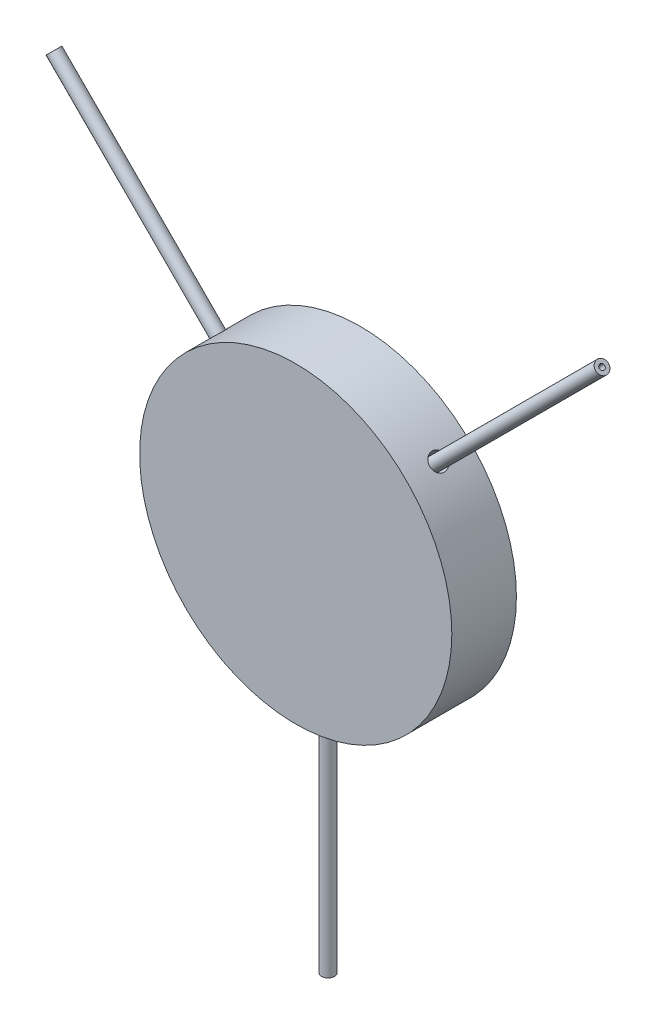
ISO-10303-21;
HEADER;
FILE_DESCRIPTION(('STEP AP214'),'2;1');
FILE_NAME('part.step','',(''),(''),'','','');
FILE_SCHEMA(('AUTOMOTIVE_DESIGN { 1 0 10303 214 1 1 1 1 }'));
ENDSEC;
DATA;
#1=APPLICATION_CONTEXT('core data for automotive mechanical design processes');
#2=APPLICATION_PROTOCOL_DEFINITION('international standard','automotive_design',2000,#1);
#3=PRODUCT_CONTEXT('',#1,'mechanical');
#4=PRODUCT('Part','Part','',(#3));
#5=PRODUCT_RELATED_PRODUCT_CATEGORY('part','',(#4));
#6=PRODUCT_DEFINITION_FORMATION('','',#4);
#7=PRODUCT_DEFINITION_CONTEXT('part definition',#1,'design');
#8=PRODUCT_DEFINITION('design','',#6,#7);
#9=PRODUCT_DEFINITION_SHAPE('','',#8);
#10=(LENGTH_UNIT() NAMED_UNIT(*) SI_UNIT(.MILLI.,.METRE.));
#11=(NAMED_UNIT(*) PLANE_ANGLE_UNIT() SI_UNIT($,.RADIAN.));
#12=(NAMED_UNIT(*) SI_UNIT($,.STERADIAN.) SOLID_ANGLE_UNIT());
#13=UNCERTAINTY_MEASURE_WITH_UNIT(LENGTH_MEASURE(1.E-05),#10,'distance_accuracy_value','');
#14=(GEOMETRIC_REPRESENTATION_CONTEXT(3) GLOBAL_UNCERTAINTY_ASSIGNED_CONTEXT((#13)) GLOBAL_UNIT_ASSIGNED_CONTEXT((#10,
#11,#12)) REPRESENTATION_CONTEXT('',''));
#15=CARTESIAN_POINT('',(0.,0.,0.));
#16=DIRECTION('',(0.,0.,1.));
#17=DIRECTION('',(1.,0.,0.));
#18=AXIS2_PLACEMENT_3D('',#15,#16,#17);
#19=CARTESIAN_POINT('',(0.,-18.,1.5));
#20=DIRECTION('',(0.,1.,0.));
#21=DIRECTION('',(0.,0.,1.));
#22=AXIS2_PLACEMENT_3D('',#19,#20,#21);
#23=CYLINDRICAL_SURFACE('',#22,0.3);
#24=CARTESIAN_POINT('',(0.,-18.,1.5));
#25=DIRECTION('',(0.,1.,0.));
#26=DIRECTION('',(0.,0.,1.));
#27=AXIS2_PLACEMENT_3D('',#24,#25,#26);
#28=CIRCLE('',#27,0.3);
#29=CARTESIAN_POINT('',(0.,-18.,1.8));
#30=VERTEX_POINT('',#29);
#31=EDGE_CURVE('E11',#30,#30,#28,.T.);
#32=ORIENTED_EDGE('',*,*,#31,.T.);
#33=EDGE_LOOP('',(#32));
#34=FACE_BOUND('',#33,.T.);
#35=CARTESIAN_POINT('',(0.,-5.,1.5));
#36=DIRECTION('',(0.,1.,0.));
#37=DIRECTION('',(0.,0.,1.));
#38=AXIS2_PLACEMENT_3D('',#35,#36,#37);
#39=CIRCLE('',#38,0.3);
#40=CARTESIAN_POINT('',(0.,-5.,1.8));
#41=VERTEX_POINT('',#40);
#42=EDGE_CURVE('E51',#41,#41,#39,.T.);
#43=ORIENTED_EDGE('',*,*,#42,.F.);
#44=EDGE_LOOP('',(#43));
#45=FACE_BOUND('',#44,.T.);
#46=ADVANCED_FACE('F48',(#34,#45),#23,.T.);
#47=CARTESIAN_POINT('',(0.,-18.,1.5));
#48=DIRECTION('',(0.,1.,0.));
#49=DIRECTION('',(0.,0.,1.));
#50=AXIS2_PLACEMENT_3D('',#47,#48,#49);
#51=PLANE('',#50);
#52=CARTESIAN_POINT('',(0.,-18.,1.5));
#53=DIRECTION('',(0.,1.,0.));
#54=DIRECTION('',(0.,0.,1.));
#55=AXIS2_PLACEMENT_3D('',#52,#53,#54);
#56=CIRCLE('',#55,0.125);
#57=CARTESIAN_POINT('',(0.,-18.,1.625));
#58=VERTEX_POINT('',#57);
#59=EDGE_CURVE('E58',#58,#58,#56,.T.);
#60=ORIENTED_EDGE('',*,*,#59,.T.);
#61=EDGE_LOOP('',(#60));
#62=FACE_BOUND('',#61,.T.);
#63=ORIENTED_EDGE('',*,*,#31,.F.);
#64=EDGE_LOOP('',(#63));
#65=FACE_BOUND('',#64,.T.);
#66=ADVANCED_FACE('F66',(#62,#65),#51,.F.);
#67=CARTESIAN_POINT('',(0.,-5.,1.5));
#68=DIRECTION('',(0.,1.,0.));
#69=DIRECTION('',(0.,0.,1.));
#70=AXIS2_PLACEMENT_3D('',#67,#68,#69);
#71=PLANE('',#70);
#72=CARTESIAN_POINT('',(0.,-5.,1.5));
#73=DIRECTION('',(0.,1.,0.));
#74=DIRECTION('',(0.,0.,1.));
#75=AXIS2_PLACEMENT_3D('',#72,#73,#74);
#76=CIRCLE('',#75,0.125);
#77=CARTESIAN_POINT('',(0.,-5.,1.625));
#78=VERTEX_POINT('',#77);
#79=EDGE_CURVE('E60',#78,#78,#76,.T.);
#80=ORIENTED_EDGE('',*,*,#79,.F.);
#81=EDGE_LOOP('',(#80));
#82=FACE_BOUND('',#81,.T.);
#83=ORIENTED_EDGE('',*,*,#42,.T.);
#84=EDGE_LOOP('',(#83));
#85=FACE_BOUND('',#84,.T.);
#86=ADVANCED_FACE('F72',(#82,#85),#71,.T.);
#87=CARTESIAN_POINT('',(0.,-18.,1.5));
#88=DIRECTION('',(0.,1.,0.));
#89=DIRECTION('',(0.,0.,1.));
#90=AXIS2_PLACEMENT_3D('',#87,#88,#89);
#91=CYLINDRICAL_SURFACE('',#90,0.125);
#92=ORIENTED_EDGE('',*,*,#59,.F.);
#93=EDGE_LOOP('',(#92));
#94=FACE_BOUND('',#93,.T.);
#95=ORIENTED_EDGE('',*,*,#79,.T.);
#96=EDGE_LOOP('',(#95));
#97=FACE_BOUND('',#96,.T.);
#98=ADVANCED_FACE('F69',(#94,#97),#91,.F.);
#99=CLOSED_SHELL('',(#46,#66,#86,#98));
#100=MANIFOLD_SOLID_BREP('B2_NOT_SHOWN',#99);
#101=CARTESIAN_POINT('',(-12.7279220613579,12.7279220613579,1.5));
#102=DIRECTION('',(-0.707106781186547,0.707106781186548,0.));
#103=DIRECTION('',(-0.707106781186548,-0.707106781186547,0.));
#104=AXIS2_PLACEMENT_3D('',#101,#102,#103);
#105=PLANE('',#104);
#106=CARTESIAN_POINT('',(-12.7279220613579,12.7279220613579,1.5));
#107=DIRECTION('',(-0.707106781186547,0.707106781186548,0.));
#108=DIRECTION('',(-0.707106781186548,-0.707106781186547,0.));
#109=AXIS2_PLACEMENT_3D('',#106,#107,#108);
#110=CIRCLE('',#109,0.3);
#111=CARTESIAN_POINT('',(-12.9400540957138,12.5157900270019,1.5));
#112=VERTEX_POINT('',#111);
#113=EDGE_CURVE('E47',#112,#112,#110,.T.);
#114=ORIENTED_EDGE('',*,*,#113,.T.);
#115=EDGE_LOOP('',(#114));
#116=FACE_BOUND('',#115,.T.);
#117=CARTESIAN_POINT('',(-12.7279220613579,12.7279220613579,1.5));
#118=DIRECTION('',(-0.707106781186547,0.707106781186548,0.));
#119=DIRECTION('',(-0.707106781186548,-0.707106781186547,0.));
#120=AXIS2_PLACEMENT_3D('',#117,#118,#119);
#121=CIRCLE('',#120,0.125);
#122=CARTESIAN_POINT('',(-12.8163104090062,12.6395337137095,1.5));
#123=VERTEX_POINT('',#122);
#124=EDGE_CURVE('E129',#123,#123,#121,.T.);
#125=ORIENTED_EDGE('',*,*,#124,.F.);
#126=EDGE_LOOP('',(#125));
#127=FACE_BOUND('',#126,.T.);
#128=ADVANCED_FACE('F118',(#116,#127),#105,.T.);
#129=CARTESIAN_POINT('',(-3.53553390593274,3.53553390593274,1.5));
#130=DIRECTION('',(-0.707106781186547,0.707106781186548,0.));
#131=DIRECTION('',(-0.707106781186548,-0.707106781186547,0.));
#132=AXIS2_PLACEMENT_3D('',#129,#130,#131);
#133=PLANE('',#132);
#134=CARTESIAN_POINT('',(-3.53553390593274,3.53553390593274,1.5));
#135=DIRECTION('',(-0.707106781186547,0.707106781186548,0.));
#136=DIRECTION('',(-0.707106781186548,-0.707106781186547,0.));
#137=AXIS2_PLACEMENT_3D('',#134,#135,#136);
#138=CIRCLE('',#137,0.3);
#139=CARTESIAN_POINT('',(-3.7476659402887,3.32340187157677,1.5));
#140=VERTEX_POINT('',#139);
#141=EDGE_CURVE('E122',#140,#140,#138,.T.);
#142=ORIENTED_EDGE('',*,*,#141,.F.);
#143=EDGE_LOOP('',(#142));
#144=FACE_BOUND('',#143,.T.);
#145=CARTESIAN_POINT('',(-3.53553390593274,3.53553390593274,1.5));
#146=DIRECTION('',(-0.707106781186547,0.707106781186548,0.));
#147=DIRECTION('',(-0.707106781186548,-0.707106781186547,0.));
#148=AXIS2_PLACEMENT_3D('',#145,#146,#147);
#149=CIRCLE('',#148,0.125);
#150=CARTESIAN_POINT('',(-3.62392225358106,3.44714555828442,1.5));
#151=VERTEX_POINT('',#150);
#152=EDGE_CURVE('E131',#151,#151,#149,.T.);
#153=ORIENTED_EDGE('',*,*,#152,.T.);
#154=EDGE_LOOP('',(#153));
#155=FACE_BOUND('',#154,.T.);
#156=ADVANCED_FACE('F141',(#144,#155),#133,.F.);
#157=CARTESIAN_POINT('',(-12.7279220613579,12.7279220613579,1.5));
#158=DIRECTION('',(0.707106781186547,-0.707106781186548,0.));
#159=DIRECTION('',(0.707106781186548,0.707106781186547,0.));
#160=AXIS2_PLACEMENT_3D('',#157,#158,#159);
#161=CYLINDRICAL_SURFACE('',#160,0.3);
#162=ORIENTED_EDGE('',*,*,#113,.F.);
#163=EDGE_LOOP('',(#162));
#164=FACE_BOUND('',#163,.T.);
#165=ORIENTED_EDGE('',*,*,#141,.T.);
#166=EDGE_LOOP('',(#165));
#167=FACE_BOUND('',#166,.T.);
#168=ADVANCED_FACE('F120',(#164,#167),#161,.T.);
#169=CARTESIAN_POINT('',(-12.7279220613579,12.7279220613579,1.5));
#170=DIRECTION('',(0.707106781186547,-0.707106781186548,0.));
#171=DIRECTION('',(0.707106781186548,0.707106781186547,0.));
#172=AXIS2_PLACEMENT_3D('',#169,#170,#171);
#173=CYLINDRICAL_SURFACE('',#172,0.125);
#174=ORIENTED_EDGE('',*,*,#124,.T.);
#175=EDGE_LOOP('',(#174));
#176=FACE_BOUND('',#175,.T.);
#177=ORIENTED_EDGE('',*,*,#152,.F.);
#178=EDGE_LOOP('',(#177));
#179=FACE_BOUND('',#178,.T.);
#180=ADVANCED_FACE('F137',(#176,#179),#173,.F.);
#181=CLOSED_SHELL('',(#128,#156,#168,#180));
#182=MANIFOLD_SOLID_BREP('B6_NOT_SHOWN',#181);
#183=CARTESIAN_POINT('',(12.7279220613579,12.7279220613579,1.5021862954209));
#184=DIRECTION('',(0.707106781186547,0.707106781186548,0.));
#185=DIRECTION('',(-0.707106781186548,0.707106781186547,0.));
#186=AXIS2_PLACEMENT_3D('',#183,#184,#185);
#187=PLANE('',#186);
#188=CARTESIAN_POINT('',(12.7279220613579,12.7279220613579,1.5021862954209));
#189=DIRECTION('',(0.707106781186547,0.707106781186548,0.));
#190=DIRECTION('',(-0.707106781186548,0.707106781186547,0.));
#191=AXIS2_PLACEMENT_3D('',#188,#189,#190);
#192=CIRCLE('',#191,0.3);
#193=CARTESIAN_POINT('',(12.5157900270019,12.9400540957138,1.5021862954209));
#194=VERTEX_POINT('',#193);
#195=EDGE_CURVE('E117',#194,#194,#192,.T.);
#196=ORIENTED_EDGE('',*,*,#195,.T.);
#197=EDGE_LOOP('',(#196));
#198=FACE_BOUND('',#197,.T.);
#199=CARTESIAN_POINT('',(12.7279220613579,12.7279220613579,1.5021862954209));
#200=DIRECTION('',(0.707106781186547,0.707106781186548,0.));
#201=DIRECTION('',(-0.707106781186548,0.707106781186547,0.));
#202=AXIS2_PLACEMENT_3D('',#199,#200,#201);
#203=CIRCLE('',#202,0.125);
#204=CARTESIAN_POINT('',(12.6395337137095,12.8163104090062,1.5021862954209));
#205=VERTEX_POINT('',#204);
#206=EDGE_CURVE('E200',#205,#205,#203,.T.);
#207=ORIENTED_EDGE('',*,*,#206,.F.);
#208=EDGE_LOOP('',(#207));
#209=FACE_BOUND('',#208,.T.);
#210=ADVANCED_FACE('F189',(#198,#209),#187,.T.);
#211=CARTESIAN_POINT('',(3.53553390593274,3.53553390593274,1.5021862954209));
#212=DIRECTION('',(0.707106781186547,0.707106781186548,0.));
#213=DIRECTION('',(-0.707106781186548,0.707106781186547,0.));
#214=AXIS2_PLACEMENT_3D('',#211,#212,#213);
#215=PLANE('',#214);
#216=CARTESIAN_POINT('',(3.53553390593274,3.53553390593274,1.5021862954209));
#217=DIRECTION('',(0.707106781186547,0.707106781186548,0.));
#218=DIRECTION('',(-0.707106781186548,0.707106781186547,0.));
#219=AXIS2_PLACEMENT_3D('',#216,#217,#218);
#220=CIRCLE('',#219,0.3);
#221=CARTESIAN_POINT('',(3.32340187157677,3.7476659402887,1.5021862954209));
#222=VERTEX_POINT('',#221);
#223=EDGE_CURVE('E193',#222,#222,#220,.T.);
#224=ORIENTED_EDGE('',*,*,#223,.F.);
#225=EDGE_LOOP('',(#224));
#226=FACE_BOUND('',#225,.T.);
#227=CARTESIAN_POINT('',(3.53553390593274,3.53553390593274,1.5021862954209));
#228=DIRECTION('',(0.707106781186547,0.707106781186548,0.));
#229=DIRECTION('',(-0.707106781186548,0.707106781186547,0.));
#230=AXIS2_PLACEMENT_3D('',#227,#228,#229);
#231=CIRCLE('',#230,0.125);
#232=CARTESIAN_POINT('',(3.44714555828442,3.62392225358106,1.5021862954209));
#233=VERTEX_POINT('',#232);
#234=EDGE_CURVE('E202',#233,#233,#231,.T.);
#235=ORIENTED_EDGE('',*,*,#234,.T.);
#236=EDGE_LOOP('',(#235));
#237=FACE_BOUND('',#236,.T.);
#238=ADVANCED_FACE('F212',(#226,#237),#215,.F.);
#239=CARTESIAN_POINT('',(12.7279220613579,12.7279220613579,1.5021862954209));
#240=DIRECTION('',(-0.707106781186547,-0.707106781186548,0.));
#241=DIRECTION('',(0.707106781186548,-0.707106781186547,0.));
#242=AXIS2_PLACEMENT_3D('',#239,#240,#241);
#243=CYLINDRICAL_SURFACE('',#242,0.3);
#244=ORIENTED_EDGE('',*,*,#195,.F.);
#245=EDGE_LOOP('',(#244));
#246=FACE_BOUND('',#245,.T.);
#247=ORIENTED_EDGE('',*,*,#223,.T.);
#248=EDGE_LOOP('',(#247));
#249=FACE_BOUND('',#248,.T.);
#250=ADVANCED_FACE('F191',(#246,#249),#243,.T.);
#251=CARTESIAN_POINT('',(12.7279220613579,12.7279220613579,1.5021862954209));
#252=DIRECTION('',(-0.707106781186547,-0.707106781186548,0.));
#253=DIRECTION('',(0.707106781186548,-0.707106781186547,0.));
#254=AXIS2_PLACEMENT_3D('',#251,#252,#253);
#255=CYLINDRICAL_SURFACE('',#254,0.125);
#256=ORIENTED_EDGE('',*,*,#206,.T.);
#257=EDGE_LOOP('',(#256));
#258=FACE_BOUND('',#257,.T.);
#259=ORIENTED_EDGE('',*,*,#234,.F.);
#260=EDGE_LOOP('',(#259));
#261=FACE_BOUND('',#260,.T.);
#262=ADVANCED_FACE('F208',(#258,#261),#255,.F.);
#263=CLOSED_SHELL('',(#210,#238,#250,#262));
#264=MANIFOLD_SOLID_BREP('B42_NOT_SHOWN',#263);
#265=CARTESIAN_POINT('',(0.,0.,3.));
#266=DIRECTION('',(0.,0.,-1.));
#267=DIRECTION('',(-1.,0.,0.));
#268=AXIS2_PLACEMENT_3D('',#265,#266,#267);
#269=CYLINDRICAL_SURFACE('',#268,7.25);
#270=CARTESIAN_POINT('',(0.,-7.25,1.9));
#271=CARTESIAN_POINT('',(-0.0224498519267231,-7.24999985273167,1.89999901034949));
#272=CARTESIAN_POINT('',(-0.0449155466798914,-7.24989460883726,1.89810366660197));
#273=CARTESIAN_POINT('',(-0.0892269629474766,-7.24948488790318,1.890569769661));
#274=CARTESIAN_POINT('',(-0.111071926060391,-7.24918017723044,1.88492682683624));
#275=CARTESIAN_POINT('',(-0.15349358792056,-7.24840600422967,1.87005998707018));
#276=CARTESIAN_POINT('',(-0.174070935443075,-7.24793662701678,1.86083793988508));
#277=CARTESIAN_POINT('',(-0.21338005744679,-7.24688595650795,1.83907757508431));
#278=CARTESIAN_POINT('',(-0.232112261164328,-7.2463046893344,1.82654003126609));
#279=CARTESIAN_POINT('',(-0.267227315234672,-7.24509482861946,1.79848795845966));
#280=CARTESIAN_POINT('',(-0.283607671513242,-7.24446618589884,1.78297030930606));
#281=CARTESIAN_POINT('',(-0.313532763873199,-7.24323284814664,1.74940484077907));
#282=CARTESIAN_POINT('',(-0.32707738310408,-7.24262815410273,1.73135691719333));
#283=CARTESIAN_POINT('',(-0.350953780315671,-7.2415105411105,1.69322963654542));
#284=CARTESIAN_POINT('',(-0.361283551713926,-7.24099767956489,1.67314902107599));
#285=CARTESIAN_POINT('',(-0.378424172349556,-7.24012218333067,1.63153521376556));
#286=CARTESIAN_POINT('',(-0.385235052591838,-7.23975954731843,1.61000203472497));
#287=CARTESIAN_POINT('',(-0.395137807194105,-7.23922585219051,1.56611781153231));
#288=CARTESIAN_POINT('',(-0.398233497299761,-7.23905459652705,1.54376763085617));
#289=CARTESIAN_POINT('',(-0.400629771970605,-7.23892238500801,1.49886424701476));
#290=CARTESIAN_POINT('',(-0.39993039152368,-7.23896142721365,1.47631104572312));
#291=CARTESIAN_POINT('',(-0.394759551023146,-7.23924522608264,1.43166778387157));
#292=CARTESIAN_POINT('',(-0.390292216033835,-7.23948975778007,1.40957724389443));
#293=CARTESIAN_POINT('',(-0.377718672538107,-7.2401566217332,1.36646009172822));
#294=CARTESIAN_POINT('',(-0.369612446163853,-7.24057895486196,1.34543348476388));
#295=CARTESIAN_POINT('',(-0.349986525644861,-7.24155408275612,1.30502779073104));
#296=CARTESIAN_POINT('',(-0.338464954474237,-7.24210694922674,1.28564961717517));
#297=CARTESIAN_POINT('',(-0.312336763745284,-7.2432807612917,1.24910085454707));
#298=CARTESIAN_POINT('',(-0.297730117417171,-7.24390170747678,1.23193028463271));
#299=CARTESIAN_POINT('',(-0.265823144633212,-7.24514269578366,1.20026013309814));
#300=CARTESIAN_POINT('',(-0.248519246885904,-7.24576273559067,1.18576414913946));
#301=CARTESIAN_POINT('',(-0.211721504128912,-7.24693123245236,1.15988239048509));
#302=CARTESIAN_POINT('',(-0.192227658500189,-7.24747968948681,1.14849661666858));
#303=CARTESIAN_POINT('',(-0.151601243810435,-7.24844324373481,1.12915880770554));
#304=CARTESIAN_POINT('',(-0.13046861289085,-7.24885833591125,1.12120690225033));
#305=CARTESIAN_POINT('',(-0.0871654546034117,-7.24950831046416,1.10896492687899));
#306=CARTESIAN_POINT('',(-0.0649949366900745,-7.24974319448188,1.10467482361295));
#307=CARTESIAN_POINT('',(-0.0202765693369092,-7.25000607133094,1.09988267618508));
#308=CARTESIAN_POINT('',(0.00227074539792376,-7.25003433590147,1.09937565661635));
#309=CARTESIAN_POINT('',(0.0471301212660416,-7.24988151055693,1.10215107872611));
#310=CARTESIAN_POINT('',(0.0694421833494029,-7.24970042148767,1.10543350509485));
#311=CARTESIAN_POINT('',(0.113183726057391,-7.2491494562456,1.11569052442225));
#312=CARTESIAN_POINT('',(0.134613741975604,-7.24877969645421,1.12266284137235));
#313=CARTESIAN_POINT('',(0.175999375166433,-7.24789300770722,1.14009941443692));
#314=CARTESIAN_POINT('',(0.195954982094769,-7.24737607771921,1.15056369504776));
#315=CARTESIAN_POINT('',(0.233848152780189,-7.24625249716785,1.17469986322166));
#316=CARTESIAN_POINT('',(0.251783592388643,-7.24564575369066,1.18837508125531));
#317=CARTESIAN_POINT('',(0.285105939602094,-7.24441116927468,1.21854007621465));
#318=CARTESIAN_POINT('',(0.300492827483852,-7.24378332817266,1.23502987492036));
#319=CARTESIAN_POINT('',(0.328298084877516,-7.24257653171065,1.2703773743197));
#320=CARTESIAN_POINT('',(0.34071323191662,-7.24199762985491,1.28923761196827));
#321=CARTESIAN_POINT('',(0.362200556163088,-7.24095483872383,1.32877782482596));
#322=CARTESIAN_POINT('',(0.371272750277436,-7.24049094886683,1.34945779083115));
#323=CARTESIAN_POINT('',(0.38581103824761,-7.23973087736011,1.39203855867289));
#324=CARTESIAN_POINT('',(0.391279176300328,-7.23943460065484,1.41393866079774));
#325=CARTESIAN_POINT('',(0.398460813863542,-7.23904290040721,1.45834780062429));
#326=CARTESIAN_POINT('',(0.400174340846878,-7.23894747539519,1.48085683386917));
#327=CARTESIAN_POINT('',(0.399797856490552,-7.23896827527617,1.52581282653404));
#328=CARTESIAN_POINT('',(0.397712913140048,-7.23908421815837,1.54825982870288));
#329=CARTESIAN_POINT('',(0.389809160587677,-7.23951409052054,1.59248456156398));
#330=CARTESIAN_POINT('',(0.383990344394406,-7.23982802037123,1.614262291003));
#331=CARTESIAN_POINT('',(0.368785102735411,-7.24061842047432,1.65653122110272));
#332=CARTESIAN_POINT('',(0.359398668634057,-7.24109489112015,1.67702241864915));
#333=CARTESIAN_POINT('',(0.337325425659902,-7.24215666152843,1.7161385362163));
#334=CARTESIAN_POINT('',(0.324638711934566,-7.24274195815327,1.73476351001903));
#335=CARTESIAN_POINT('',(0.29630659425397,-7.2439563173559,1.76964399144573));
#336=CARTESIAN_POINT('',(0.280657592510956,-7.2445854325592,1.78589657476895));
#337=CARTESIAN_POINT('',(0.2468487173008,-7.24581611787472,1.81554926078093));
#338=CARTESIAN_POINT('',(0.228688228397321,-7.24641768118714,1.82894866225129));
#339=CARTESIAN_POINT('',(0.190355164235812,-7.24752597245616,1.85252227339318));
#340=CARTESIAN_POINT('',(0.170180465960038,-7.24803259869457,1.86269303181104));
#341=CARTESIAN_POINT('',(0.128421925685863,-7.2488924758191,1.87949064740542));
#342=CARTESIAN_POINT('',(0.106839776462649,-7.24924590718059,1.88612167680076));
#343=CARTESIAN_POINT('',(0.0709369361591975,-7.24966642229911,1.89391840485355));
#344=CARTESIAN_POINT('',(0.0568486144208318,-7.24979096179987,1.89619607698614));
#345=CARTESIAN_POINT('',(0.0285089916896704,-7.24995779737135,1.89923718802048));
#346=CARTESIAN_POINT('',(0.0142576908686212,-7.25000009352874,1.90000062851778));
#347=CARTESIAN_POINT('',(0.,-7.25,1.9));
#348=B_SPLINE_CURVE_WITH_KNOTS('',3,(#270,#271,#272,#273,#274,#275,#276,#277,#278,#279,#280,
#281,#282,#283,#284,#285,#286,#287,#288,#289,#290,#291,#292,#293,#294,#295,#296,#297,#298,#299,
#300,#301,#302,#303,#304,#305,#306,#307,#308,#309,#310,#311,#312,#313,#314,#315,#316,#317,#318,
#319,#320,#321,#322,#323,#324,#325,#326,#327,#328,#329,#330,#331,#332,#333,#334,#335,#336,#337,
#338,#339,#340,#341,#342,#343,#344,#345,#346,#347),.UNSPECIFIED.,.T.,.F.,(4,2,2,2,2,2,2,2,2,2,2,
2,2,2,2,2,2,2,2,2,2,2,2,2,2,2,2,2,2,2,2,2,2,2,2,2,2,2,4),(0.,0.0672975086809392,
0.134673983520043,0.202015683054899,0.269341679688496,0.336738554664312,0.404138206276108,
0.471579842138207,0.539020883762753,0.606392599541413,0.673763694201197,0.74106112822814,
0.808358892705393,0.875693711885606,0.943029115366818,1.01045444359218,1.07787979087689,
1.14530768447838,1.21273496397247,1.28007354931908,1.34741186261211,1.41470868842824,
1.48200598634619,1.54937339761123,1.61674133020825,1.68418198708481,1.75162230287562,
1.81902433396966,1.8864258718751,1.95373754725535,2.02104934867217,2.08836131302223,
2.1556713369752,2.22306364166913,2.29047249011039,2.35795315438448,2.42535410372548,
2.46809416674077,2.51083418472098),.UNSPECIFIED.);
#349=CARTESIAN_POINT('',(0.,-7.25,1.9));
#350=VERTEX_POINT('',#349);
#351=EDGE_CURVE('E341',#350,#350,#348,.T.);
#352=ORIENTED_EDGE('',*,*,#351,.F.);
#353=EDGE_LOOP('',(#352));
#354=FACE_BOUND('',#353,.T.);
#355=CARTESIAN_POINT('',(0.,0.,3.));
#356=DIRECTION('',(0.,0.,1.));
#357=DIRECTION('',(1.,0.,0.));
#358=AXIS2_PLACEMENT_3D('',#355,#356,#357);
#359=CIRCLE('',#358,7.25);
#360=CARTESIAN_POINT('',(7.25,0.,3.));
#361=VERTEX_POINT('',#360);
#362=EDGE_CURVE('E348',#361,#361,#359,.T.);
#363=ORIENTED_EDGE('',*,*,#362,.F.);
#364=EDGE_LOOP('',(#363));
#365=FACE_BOUND('',#364,.T.);
#366=CARTESIAN_POINT('',(0.,0.,0.));
#367=DIRECTION('',(0.,0.,1.));
#368=DIRECTION('',(1.,0.,0.));
#369=AXIS2_PLACEMENT_3D('',#366,#367,#368);
#370=CIRCLE('',#369,7.25);
#371=CARTESIAN_POINT('',(7.25,0.,0.));
#372=VERTEX_POINT('',#371);
#373=EDGE_CURVE('E347',#372,#372,#370,.T.);
#374=ORIENTED_EDGE('',*,*,#373,.T.);
#375=EDGE_LOOP('',(#374));
#376=FACE_BOUND('',#375,.T.);
#377=CARTESIAN_POINT('',(-4.83587294675085,5.40155837170009,1.5));
#378=CARTESIAN_POINT('',(-4.8358737512864,5.40155777662082,1.52244982260147));
#379=CARTESIAN_POINT('',(-4.83728849331815,5.40029210458516,1.54491548812876));
#380=CARTESIAN_POINT('',(-4.84290588033164,5.39525498168596,1.58922684366934));
#381=CARTESIAN_POINT('',(-4.84711179474406,5.39148059223633,1.61107177525824));
#382=CARTESIAN_POINT('',(-4.85817227811935,5.38151625475761,1.65349337048094));
#383=CARTESIAN_POINT('',(-4.86502547833581,5.37532755500146,1.67407068315702));
#384=CARTESIAN_POINT('',(-4.88115586258618,5.36068424036268,1.71337974685388));
#385=CARTESIAN_POINT('',(-4.89043248107181,5.35223015413694,1.73211192706688));
#386=CARTESIAN_POINT('',(-4.91112404980993,5.33325016126809,1.76722700800536));
#387=CARTESIAN_POINT('',(-4.92254124768003,5.32272207632257,1.78360740713362));
#388=CARTESIAN_POINT('',(-4.94714759519088,5.29985963178116,1.81353258210042));
#389=CARTESIAN_POINT('',(-4.96033681773162,5.28752519787134,1.82707724121972));
#390=CARTESIAN_POINT('',(-4.98808664056538,5.26135487035665,1.8509536798877));
#391=CARTESIAN_POINT('',(-5.00264808687903,5.24751804967083,1.86128346025099));
#392=CARTESIAN_POINT('',(-5.03269188055208,5.21871105818778,1.87842409975566));
#393=CARTESIAN_POINT('',(-5.04817421982455,5.2037408973428,1.88523498979346));
#394=CARTESIAN_POINT('',(-5.07958189319482,5.1730869472463,1.89513776524272));
#395=CARTESIAN_POINT('',(-5.09550675546402,5.1574039075323,1.89823346712726));
#396=CARTESIAN_POINT('',(-5.12735156406097,5.12574579374711,1.90062977188378));
#397=CARTESIAN_POINT('',(-5.14327151043254,5.10977072236001,1.89993040961905));
#398=CARTESIAN_POINT('',(-5.17463874305505,5.07800273415294,1.89475959762858));
#399=CARTESIAN_POINT('',(-5.19008652493678,5.06220963798458,1.89029225467208));
#400=CARTESIAN_POINT('',(-5.22010414867581,5.03125013253478,1.87771866159991));
#401=CARTESIAN_POINT('',(-5.23467398626472,5.01608372630029,1.86961239379415));
#402=CARTESIAN_POINT('',(-5.26255633161009,4.98682363376945,1.84998638806183));
#403=CARTESIAN_POINT('',(-5.27586814630458,4.97273053959571,1.83846478287077));
#404=CARTESIAN_POINT('',(-5.30088244355809,4.94605703551127,1.81233651983765));
#405=CARTESIAN_POINT('',(-5.31258491214017,4.93347663873824,1.7977298352049));
#406=CARTESIAN_POINT('',(-5.3341015387711,4.91020497019461,1.76582283559009));
#407=CARTESIAN_POINT('',(-5.34391315970067,4.89951623818764,1.74851895704947));
#408=CARTESIAN_POINT('',(-5.36138759322727,4.88038845408114,1.71172126876554));
#409=CARTESIAN_POINT('',(-5.36905040515382,4.87194940268356,1.69222745833894));
#410=CARTESIAN_POINT('',(-5.38204229282738,4.85759353619365,1.65160105245915));
#411=CARTESIAN_POINT('',(-5.3873712725629,4.8516768248681,1.63046838962733));
#412=CARTESIAN_POINT('',(-5.39556745030724,4.84256025184769,1.58716516208428));
#413=CARTESIAN_POINT('',(-5.39843467086376,4.83936036526895,1.56499460688126));
#414=CARTESIAN_POINT('',(-5.40163704516824,4.83578567643219,1.52027622334155));
#415=CARTESIAN_POINT('',(-5.40197553140551,4.83540715604182,1.49772893079941));
#416=CARTESIAN_POINT('',(-5.40012121832752,4.83747792599163,1.4528696039836));
#417=CARTESIAN_POINT('',(-5.39792842923773,4.83992720490846,1.43055756875994));
#418=CARTESIAN_POINT('',(-5.391065747075,4.84757013258017,1.3868161537923));
#419=CARTESIAN_POINT('',(-5.38639738866391,4.85276208108402,1.36538623606325));
#420=CARTESIAN_POINT('',(-5.37469557890585,4.86571918627274,1.32400078724452));
#421=CARTESIAN_POINT('',(-5.36766211086011,4.87348436112577,1.30404526656598));
#422=CARTESIAN_POINT('',(-5.35139032488051,4.89134614835284,1.26615215285433));
#423=CARTESIAN_POINT('',(-5.34214970702225,4.90144519233829,1.24821669367381));
#424=CARTESIAN_POINT('',(-5.32169295889925,4.92364817092619,1.21489430136679));
#425=CARTESIAN_POINT('',(-5.31047681341209,4.93575212097742,1.19950738787988));
#426=CARTESIAN_POINT('',(-5.28633537786955,4.96159961480418,1.17170207770635));
#427=CARTESIAN_POINT('',(-5.27340825578067,4.97534491449503,1.15928690361102));
#428=CARTESIAN_POINT('',(-5.24618583585618,5.00404084552929,1.13779953183907));
#429=CARTESIAN_POINT('',(-5.23189054494129,5.01899147077565,1.12872731725361));
#430=CARTESIAN_POINT('',(-5.20231821059445,5.04963741534764,1.11418901517143));
#431=CARTESIAN_POINT('',(-5.18704173154674,5.06533230523275,1.10872087462268));
#432=CARTESIAN_POINT('',(-5.15591635747778,5.09701082854828,1.10153921947707));
#433=CARTESIAN_POINT('',(-5.1400674666158,5.1129944598802,1.09982567760404));
#434=CARTESIAN_POINT('',(-5.10826407610426,5.14476848295076,1.10020211961478));
#435=CARTESIAN_POINT('',(-5.09230974473902,5.16055910320986,1.10228705325203));
#436=CARTESIAN_POINT('',(-5.06073450583364,5.19152727809202,1.11019081048931));
#437=CARTESIAN_POINT('',(-5.04511359890692,5.20670483158722,1.11600964095821));
#438=CARTESIAN_POINT('',(-5.01466661057042,5.23603533261346,1.13121493666191));
#439=CARTESIAN_POINT('',(-4.99984053110332,5.25018827764024,1.14060141061611));
#440=CARTESIAN_POINT('',(-4.97143097844796,5.27709743535554,1.16267475400545));
#441=CARTESIAN_POINT('',(-4.95784746942432,5.28985368832634,1.17536152822032));
#442=CARTESIAN_POINT('',(-4.93232483378997,5.31365949432265,1.20369371121775));
#443=CARTESIAN_POINT('',(-4.92038772975614,5.32470695011131,1.21934270404151));
#444=CARTESIAN_POINT('',(-4.89854977904857,5.34480410703462,1.25315154298262));
#445=CARTESIAN_POINT('',(-4.88864943304705,5.35385331700406,1.27131200463454));
#446=CARTESIAN_POINT('',(-4.87119618599868,5.36973812866152,1.30964504783172));
#447=CARTESIAN_POINT('',(-4.8636458028874,5.37657135629786,1.32981975725002));
#448=CARTESIAN_POINT('',(-4.8511594176905,5.38784035678703,1.371578321397));
#449=CARTESIAN_POINT('',(-4.84622033766267,5.39227895231874,1.39316048328728));
#450=CARTESIAN_POINT('',(-4.84040948101268,5.39749428747087,1.4290632929075));
#451=CARTESIAN_POINT('',(-4.83871074239889,5.39901664267031,1.44315156895929));
#452=CARTESIAN_POINT('',(-4.83644222038982,5.40104887321301,1.47149110010141));
#453=CARTESIAN_POINT('',(-4.83587243579882,5.40155874962864,1.4857423550191));
#454=CARTESIAN_POINT('',(-4.83587294675085,5.40155837170009,1.5));
#455=B_SPLINE_CURVE_WITH_KNOTS('',3,(#377,#378,#379,#380,#381,#382,#383,#384,#385,#386,#387,
#388,#389,#390,#391,#392,#393,#394,#395,#396,#397,#398,#399,#400,#401,#402,#403,#404,#405,#406,
#407,#408,#409,#410,#411,#412,#413,#414,#415,#416,#417,#418,#419,#420,#421,#422,#423,#424,#425,
#426,#427,#428,#429,#430,#431,#432,#433,#434,#435,#436,#437,#438,#439,#440,#441,#442,#443,#444,
#445,#446,#447,#448,#449,#450,#451,#452,#453,#454),.UNSPECIFIED.,.T.,.F.,(4,2,2,2,2,2,2,2,2,2,2,
2,2,2,2,2,2,2,2,2,2,2,2,2,2,2,2,2,2,2,2,2,2,2,2,2,2,2,4),(0.,0.0672974206088428,
0.134673809298565,0.20201540838647,0.269341306117105,0.336738296308297,0.404138060018741,
0.471579653184174,0.539020654191487,0.606392316130023,0.67376335916101,0.741061068393707,
0.808359104787713,0.87569400305554,0.943029486080538,1.01045469949871,1.07787993395507,
1.14530794195698,1.21273533236715,1.28007384797525,1.34741209155978,1.41470863934943,
1.48200566229391,1.54937311930984,1.61674109544873,1.68418179861048,1.75162216064954,
1.81902407217068,1.8864254940331,1.953737368018,2.02104936583005,2.08836152815516,
2.15567174860506,2.22306393555531,2.29047266899026,2.35795338276555,2.42535437870864,
2.46809430429549,2.51083418461457),.UNSPECIFIED.);
#456=CARTESIAN_POINT('',(-4.83587294675085,5.40155837170009,1.5));
#457=VERTEX_POINT('',#456);
#458=EDGE_CURVE('E303',#457,#457,#455,.T.);
#459=ORIENTED_EDGE('',*,*,#458,.T.);
#460=EDGE_LOOP('',(#459));
#461=FACE_BOUND('',#460,.T.);
#462=CARTESIAN_POINT('',(5.40155837170008,4.83587294675085,1.5021862954209));
#463=CARTESIAN_POINT('',(5.40155777662082,4.8358737512864,1.52463611802237));
#464=CARTESIAN_POINT('',(5.40029210458516,4.83728849331815,1.54710178354966));
#465=CARTESIAN_POINT('',(5.39525498168596,4.84290588033164,1.59141313909024));
#466=CARTESIAN_POINT('',(5.39148059223633,4.84711179474406,1.61325807067915));
#467=CARTESIAN_POINT('',(5.38151625475761,4.85817227811935,1.65567966590184));
#468=CARTESIAN_POINT('',(5.37532755500145,4.86502547833581,1.67625697857793));
#469=CARTESIAN_POINT('',(5.36068424036268,4.88115586258618,1.71556604227478));
#470=CARTESIAN_POINT('',(5.35223015413694,4.89043248107181,1.73429822248778));
#471=CARTESIAN_POINT('',(5.33325016126809,4.91112404980993,1.76941330342627));
#472=CARTESIAN_POINT('',(5.32272207632256,4.92254124768003,1.78579370255452));
#473=CARTESIAN_POINT('',(5.29985963178116,4.94714759519088,1.81571887752132));
#474=CARTESIAN_POINT('',(5.28752519787134,4.96033681773162,1.82926353664063));
#475=CARTESIAN_POINT('',(5.26135487035665,4.98808664056538,1.8531399753086));
#476=CARTESIAN_POINT('',(5.24751804967083,5.00264808687904,1.86346975567189));
#477=CARTESIAN_POINT('',(5.21871105818778,5.03269188055208,1.88061039517656));
#478=CARTESIAN_POINT('',(5.2037408973428,5.04817421982455,1.88742128521436));
#479=CARTESIAN_POINT('',(5.1730869472463,5.07958189319482,1.89732406066362));
#480=CARTESIAN_POINT('',(5.1574039075323,5.09550675546402,1.90041976254816));
#481=CARTESIAN_POINT('',(5.12574579374711,5.12735156406097,1.90281606730468));
#482=CARTESIAN_POINT('',(5.10977072236001,5.14327151043254,1.90211670503995));
#483=CARTESIAN_POINT('',(5.07800273415293,5.17463874305505,1.89694589304948));
#484=CARTESIAN_POINT('',(5.06220963798458,5.19008652493678,1.89247855009298));
#485=CARTESIAN_POINT('',(5.03125013253478,5.22010414867581,1.87990495702081));
#486=CARTESIAN_POINT('',(5.01608372630029,5.23467398626472,1.87179868921506));
#487=CARTESIAN_POINT('',(4.98682363376945,5.26255633161009,1.85217268348273));
#488=CARTESIAN_POINT('',(4.97273053959571,5.27586814630458,1.84065107829167));
#489=CARTESIAN_POINT('',(4.94605703551126,5.30088244355809,1.81452281525855));
#490=CARTESIAN_POINT('',(4.93347663873824,5.31258491214017,1.79991613062581));
#491=CARTESIAN_POINT('',(4.91020497019461,5.3341015387711,1.768009131011));
#492=CARTESIAN_POINT('',(4.89951623818764,5.34391315970067,1.75070525247037));
#493=CARTESIAN_POINT('',(4.88038845408114,5.36138759322727,1.71390756418644));
#494=CARTESIAN_POINT('',(4.87194940268356,5.36905040515382,1.69441375375984));
#495=CARTESIAN_POINT('',(4.85759353619364,5.38204229282738,1.65378734788005));
#496=CARTESIAN_POINT('',(4.8516768248681,5.3873712725629,1.63265468504823));
#497=CARTESIAN_POINT('',(4.84256025184769,5.39556745030724,1.58935145750518));
#498=CARTESIAN_POINT('',(4.83936036526895,5.39843467086376,1.56718090230216));
#499=CARTESIAN_POINT('',(4.83578567643218,5.40163704516824,1.52246251876245));
#500=CARTESIAN_POINT('',(4.83540715604182,5.40197553140552,1.49991522622031));
#501=CARTESIAN_POINT('',(4.83747792599163,5.40012121832752,1.4550558994045));
#502=CARTESIAN_POINT('',(4.83992720490846,5.39792842923773,1.43274386418084));
#503=CARTESIAN_POINT('',(4.84757013258017,5.391065747075,1.3890024492132));
#504=CARTESIAN_POINT('',(4.85276208108402,5.38639738866391,1.36757253148415));
#505=CARTESIAN_POINT('',(4.86571918627274,5.37469557890585,1.32618708266542));
#506=CARTESIAN_POINT('',(4.87348436112577,5.36766211086011,1.30623156198689));
#507=CARTESIAN_POINT('',(4.89134614835284,5.35139032488051,1.26833844827523));
#508=CARTESIAN_POINT('',(4.90144519233829,5.34214970702225,1.25040298909472));
#509=CARTESIAN_POINT('',(4.92364817092619,5.32169295889925,1.21708059678769));
#510=CARTESIAN_POINT('',(4.93575212097742,5.31047681341209,1.20169368330078));
#511=CARTESIAN_POINT('',(4.96159961480418,5.28633537786955,1.17388837312726));
#512=CARTESIAN_POINT('',(4.97534491449502,5.27340825578067,1.16147319903192));
#513=CARTESIAN_POINT('',(5.00404084552928,5.24618583585618,1.13998582725997));
#514=CARTESIAN_POINT('',(5.01899147077565,5.2318905449413,1.13091361267451));
#515=CARTESIAN_POINT('',(5.04963741534764,5.20231821059446,1.11637531059233));
#516=CARTESIAN_POINT('',(5.06533230523275,5.18704173154674,1.11090717004358));
#517=CARTESIAN_POINT('',(5.09701082854827,5.15591635747778,1.10372551489797));
#518=CARTESIAN_POINT('',(5.1129944598802,5.1400674666158,1.10201197302494));
#519=CARTESIAN_POINT('',(5.14476848295076,5.10826407610426,1.10238841503568));
#520=CARTESIAN_POINT('',(5.16055910320986,5.09230974473902,1.10447334867293));
#521=CARTESIAN_POINT('',(5.19152727809202,5.06073450583364,1.11237710591021));
#522=CARTESIAN_POINT('',(5.20670483158722,5.04511359890692,1.11819593637912));
#523=CARTESIAN_POINT('',(5.23603533261346,5.01466661057042,1.13340123208281));
#524=CARTESIAN_POINT('',(5.25018827764024,4.99984053110333,1.14278770603701));
#525=CARTESIAN_POINT('',(5.27709743535554,4.97143097844796,1.16486104942635));
#526=CARTESIAN_POINT('',(5.28985368832634,4.95784746942433,1.17754782364122));
#527=CARTESIAN_POINT('',(5.31365949432265,4.93232483378997,1.20588000663866));
#528=CARTESIAN_POINT('',(5.32470695011131,4.92038772975614,1.22152899946241));
#529=CARTESIAN_POINT('',(5.34480410703462,4.89854977904857,1.25533783840352));
#530=CARTESIAN_POINT('',(5.35385331700405,4.88864943304705,1.27349830005544));
#531=CARTESIAN_POINT('',(5.36973812866152,4.87119618599869,1.31183134325263));
#532=CARTESIAN_POINT('',(5.37657135629786,4.8636458028874,1.33200605267092));
#533=CARTESIAN_POINT('',(5.38784035678703,4.85115941769051,1.3737646168179));
#534=CARTESIAN_POINT('',(5.39227895231874,4.84622033766267,1.39534677870818));
#535=CARTESIAN_POINT('',(5.39749428747087,4.84040948101268,1.4312495883284));
#536=CARTESIAN_POINT('',(5.39901664267031,4.83871074239889,1.44533786438019));
#537=CARTESIAN_POINT('',(5.40104887321301,4.83644222038982,1.47367739552231));
#538=CARTESIAN_POINT('',(5.40155874962863,4.83587243579882,1.48792865044));
#539=CARTESIAN_POINT('',(5.40155837170008,4.83587294675085,1.5021862954209));
#540=B_SPLINE_CURVE_WITH_KNOTS('',3,(#462,#463,#464,#465,#466,#467,#468,#469,#470,#471,#472,
#473,#474,#475,#476,#477,#478,#479,#480,#481,#482,#483,#484,#485,#486,#487,#488,#489,#490,#491,
#492,#493,#494,#495,#496,#497,#498,#499,#500,#501,#502,#503,#504,#505,#506,#507,#508,#509,#510,
#511,#512,#513,#514,#515,#516,#517,#518,#519,#520,#521,#522,#523,#524,#525,#526,#527,#528,#529,
#530,#531,#532,#533,#534,#535,#536,#537,#538,#539),.UNSPECIFIED.,.T.,.F.,(4,2,2,2,2,2,2,2,2,2,2,
2,2,2,2,2,2,2,2,2,2,2,2,2,2,2,2,2,2,2,2,2,2,2,2,2,2,2,4),(0.,0.067297420608843,
0.134673809298565,0.20201540838647,0.269341306117105,0.336738296308297,0.404138060018741,
0.471579653184174,0.539020654191486,0.606392316130023,0.67376335916101,0.741061068393706,
0.808359104787711,0.875694003055537,0.943029486080537,1.01045469949871,1.07787993395507,
1.14530794195698,1.21273533236715,1.28007384797525,1.34741209155978,1.41470863934943,
1.48200566229391,1.54937311930984,1.61674109544873,1.68418179861049,1.75162216064954,
1.81902407217068,1.8864254940331,1.953737368018,2.02104936583005,2.08836152815517,
2.15567174860506,2.22306393555531,2.29047266899026,2.35795338276555,2.42535437870864,
2.46809430429549,2.51083418461457),.UNSPECIFIED.);
#541=CARTESIAN_POINT('',(5.40155837170008,4.83587294675085,1.5021862954209));
#542=VERTEX_POINT('',#541);
#543=EDGE_CURVE('E298',#542,#542,#540,.T.);
#544=ORIENTED_EDGE('',*,*,#543,.T.);
#545=EDGE_LOOP('',(#544));
#546=FACE_BOUND('',#545,.T.);
#547=ADVANCED_FACE('F251',(#354,#365,#376,#461,#546),#269,.T.);
#548=CARTESIAN_POINT('',(0.,-7.251,1.5));
#549=DIRECTION('',(0.,1.,0.));
#550=DIRECTION('',(0.,0.,1.));
#551=AXIS2_PLACEMENT_3D('',#548,#549,#550);
#552=CYLINDRICAL_SURFACE('',#551,0.4);
#553=ORIENTED_EDGE('',*,*,#351,.T.);
#554=EDGE_LOOP('',(#553));
#555=FACE_BOUND('',#554,.T.);
#556=CARTESIAN_POINT('',(0.,0.,1.5));
#557=DIRECTION('',(0.707106781186547,0.707106781186548,0.));
#558=DIRECTION('',(-0.707106781186548,0.707106781186547,0.));
#559=AXIS2_PLACEMENT_3D('',#556,#557,#558);
#560=ELLIPSE('',#559,0.565685424949238,0.4);
#561=CARTESIAN_POINT('',(0.041650317215724,-0.041650317215724,1.89782565411978));
#562=VERTEX_POINT('',#561);
#563=CARTESIAN_POINT('',(0.,0.,1.9));
#564=VERTEX_POINT('',#563);
#565=EDGE_CURVE('E292',#562,#564,#560,.F.);
#566=ORIENTED_EDGE('',*,*,#565,.F.);
#567=CARTESIAN_POINT('',(0.0589024434836228,0.,1.10436064130112));
#568=CARTESIAN_POINT('',(0.0642562784935511,-0.00523633925100421,1.10514598557897));
#569=CARTESIAN_POINT('',(0.0700492146069441,-0.00986731677211245,1.10612991329857));
#570=CARTESIAN_POINT('',(0.082089815156553,-0.0183192541208065,1.10846971120459));
#571=CARTESIAN_POINT('',(0.0883344973213794,-0.0221449725145578,1.10982328113844));
#572=CARTESIAN_POINT('',(0.107200407503271,-0.0330726651881403,1.1144125521819));
#573=CARTESIAN_POINT('',(0.119979458213229,-0.039643768538709,1.11818030876529));
#574=CARTESIAN_POINT('',(0.153897586378036,-0.0564082089890086,1.13010649013015));
#575=CARTESIAN_POINT('',(0.174874116699145,-0.0660625684591922,1.13951324349088));
#576=CARTESIAN_POINT('',(0.21527943169298,-0.0843260359677074,1.16207411027041));
#577=CARTESIAN_POINT('',(0.234704075053572,-0.0929323773731835,1.17523784824765));
#578=CARTESIAN_POINT('',(0.271153632751093,-0.108956966732913,1.20499768533816));
#579=CARTESIAN_POINT('',(0.28818787083432,-0.116379847125628,1.22157978822224));
#580=CARTESIAN_POINT('',(0.319240237847683,-0.129886357372,1.25781374452253));
#581=CARTESIAN_POINT('',(0.333261246802492,-0.135971266180115,1.27746263542728));
#582=CARTESIAN_POINT('',(0.356876718614828,-0.14624141396323,1.31792392777508));
#583=CARTESIAN_POINT('',(0.366699270939412,-0.150524253590039,1.33857825078546));
#584=CARTESIAN_POINT('',(0.382725953202856,-0.157567418048458,1.3814899109091));
#585=CARTESIAN_POINT('',(0.3889316041786,-0.160328382856527,1.40374656975207));
#586=CARTESIAN_POINT('',(0.397121769496577,-0.164077661695645,1.44751631942083));
#587=CARTESIAN_POINT('',(0.399374881329617,-0.165177990095987,1.46896987780681));
#588=CARTESIAN_POINT('',(0.400398343915734,-0.165934740682939,1.51198311899451));
#589=CARTESIAN_POINT('',(0.39916952823603,-0.165591508445857,1.53354277516305));
#590=CARTESIAN_POINT('',(0.393374724906289,-0.163523919282038,1.57542542821848));
#591=CARTESIAN_POINT('',(0.388917598432843,-0.161844443906955,1.59576588580653));
#592=CARTESIAN_POINT('',(0.376961660769014,-0.157240207005364,1.63538116767874));
#593=CARTESIAN_POINT('',(0.369462706534629,-0.15431538691536,1.65465594179997));
#594=CARTESIAN_POINT('',(0.351526808732033,-0.147278472497311,1.69200566589374));
#595=CARTESIAN_POINT('',(0.341037393577595,-0.143145136663831,1.71005132793964));
#596=CARTESIAN_POINT('',(0.317538442557424,-0.133880313455686,1.74412690655127));
#597=CARTESIAN_POINT('',(0.304528629708449,-0.128748716375206,1.76015660124937));
#598=CARTESIAN_POINT('',(0.275553312356896,-0.117357892004338,1.79075752271639));
#599=CARTESIAN_POINT('',(0.259459688371017,-0.111050357666959,1.80518918770927));
#600=CARTESIAN_POINT('',(0.225322368102289,-0.0977954800210642,1.8311961975332));
#601=CARTESIAN_POINT('',(0.207276876629261,-0.0908475486037041,1.84276888019773));
#602=CARTESIAN_POINT('',(0.173910155664352,-0.0783009702248627,1.86059406756318));
#603=CARTESIAN_POINT('',(0.158892575048312,-0.0727514797375419,1.86745780510133));
#604=CARTESIAN_POINT('',(0.128130163552296,-0.0618732622072858,1.87928040027618));
#605=CARTESIAN_POINT('',(0.11238871977109,-0.056543692082228,1.88424728370623));
#606=CARTESIAN_POINT('',(0.087449374130021,-0.0491874985815293,1.89042849815224));
#607=CARTESIAN_POINT('',(0.0785538768713005,-0.0467655482251238,1.89231989180248));
#608=CARTESIAN_POINT('',(0.0603902106449872,-0.0430969387270176,1.8955218003823));
#609=CARTESIAN_POINT('',(0.0511202872341581,-0.0418567029019164,1.89682912035079));
#610=CARTESIAN_POINT('',(0.0416503172157228,-0.0416503172157247,1.89782565411978));
#611=B_SPLINE_CURVE_WITH_KNOTS('',3,(#567,#568,#569,#570,#571,#572,#573,#574,#575,#576,#577,
#578,#579,#580,#581,#582,#583,#584,#585,#586,#587,#588,#589,#590,#591,#592,#593,#594,#595,#596,
#597,#598,#599,#600,#601,#602,#603,#604,#605,#606,#607,#608,#609,#610),.UNSPECIFIED.,.F.,.F.,(4,
2,2,2,2,2,2,2,2,2,2,2,2,2,2,2,2,2,2,2,2,4),(0.,0.0224273009936438,0.0447180996996949,
0.0892046216064837,0.16363481157319,0.238257413456045,0.312580340276828,0.386831910644585,
0.456268448276675,0.525675764243139,0.590151430696805,0.654611663095413,0.716993820249721,
0.779378911307188,0.84293420742729,0.906496492027114,0.973765411447993,1.04109673479933,
1.09324046574988,1.14516105994308,1.17331944738461,1.20163003355076),.UNSPECIFIED.);
#612=CARTESIAN_POINT('',(0.058902443483621,0.,1.10436064130112));
#613=VERTEX_POINT('',#612);
#614=EDGE_CURVE('E287',#613,#562,#611,.T.);
#615=ORIENTED_EDGE('',*,*,#614,.F.);
#616=CARTESIAN_POINT('',(0.,0.,1.5));
#617=DIRECTION('',(0.,1.,0.));
#618=DIRECTION('',(0.,0.,1.));
#619=AXIS2_PLACEMENT_3D('',#616,#617,#618);
#620=CIRCLE('',#619,0.4);
#621=CARTESIAN_POINT('',(0.,0.,1.1));
#622=VERTEX_POINT('',#621);
#623=EDGE_CURVE('E273',#613,#622,#620,.T.);
#624=ORIENTED_EDGE('',*,*,#623,.T.);
#625=CARTESIAN_POINT('',(0.,0.,1.5));
#626=DIRECTION('',(-0.38268343236509,0.923879532511287,0.));
#627=DIRECTION('',(0.923879532511287,0.38268343236509,0.));
#628=AXIS2_PLACEMENT_3D('',#625,#626,#627);
#629=ELLIPSE('',#628,0.432956880116958,0.4);
#630=EDGE_CURVE('E302',#564,#622,#629,.F.);
#631=ORIENTED_EDGE('',*,*,#630,.F.);
#632=EDGE_LOOP('',(#566,#615,#624,#631));
#633=FACE_BOUND('',#632,.T.);
#634=ADVANCED_FACE('F300',(#555,#633),#552,.F.);
#635=CARTESIAN_POINT('',(0.,0.,1.5));
#636=DIRECTION('',(-0.707106781186547,0.707106781186548,0.));
#637=DIRECTION('',(-0.707106781186548,-0.707106781186547,0.));
#638=AXIS2_PLACEMENT_3D('',#635,#636,#637);
#639=PLANE('',#638);
#640=DIRECTION('',(0.,0.,1.));
#641=VECTOR('',#640,1.);
#642=CARTESIAN_POINT('',(0.,0.,1.5));
#643=LINE('',#642,#641);
#644=CARTESIAN_POINT('',(0.,0.,1.1021862954209));
#645=VERTEX_POINT('',#644);
#646=EDGE_CURVE('E351',#622,#645,#643,.T.);
#647=ORIENTED_EDGE('',*,*,#646,.T.);
#648=DIRECTION('',(-0.707106781186547,-0.707106781186548,0.));
#649=VECTOR('',#648,1.);
#650=CARTESIAN_POINT('',(7.251,7.251,1.1021862954209));
#651=LINE('',#650,#649);
#652=CARTESIAN_POINT('',(0.0295318171558537,0.0295318171558511,1.1021862954209));
#653=VERTEX_POINT('',#652);
#654=EDGE_CURVE('E297',#645,#653,#651,.F.);
#655=ORIENTED_EDGE('',*,*,#654,.T.);
#656=CARTESIAN_POINT('',(0.,0.,1.5));
#657=DIRECTION('',(-0.707106781186547,0.707106781186548,0.));
#658=DIRECTION('',(-0.707106781186548,-0.707106781186547,0.));
#659=AXIS2_PLACEMENT_3D('',#656,#657,#658);
#660=CIRCLE('',#659,0.4);
#661=EDGE_CURVE('E306',#653,#622,#660,.T.);
#662=ORIENTED_EDGE('',*,*,#661,.T.);
#663=EDGE_LOOP('',(#647,#655,#662));
#664=FACE_BOUND('',#663,.T.);
#665=ADVANCED_FACE('F335',(#664),#639,.T.);
#666=CARTESIAN_POINT('',(-7.251,7.251,1.5));
#667=DIRECTION('',(0.707106781186547,-0.707106781186548,0.));
#668=DIRECTION('',(0.707106781186548,0.707106781186547,0.));
#669=AXIS2_PLACEMENT_3D('',#666,#667,#668);
#670=CYLINDRICAL_SURFACE('',#669,0.4);
#671=ORIENTED_EDGE('',*,*,#458,.F.);
#672=EDGE_LOOP('',(#671));
#673=FACE_BOUND('',#672,.T.);
#674=CARTESIAN_POINT('',(0.0295318171558537,0.0295318171558511,1.1021862954209));
#675=CARTESIAN_POINT('',(0.0273460228214251,0.03169127733567,1.10218531430825));
#676=CARTESIAN_POINT('',(0.0254493625516043,0.0340903579795793,1.1022215286246));
#677=CARTESIAN_POINT('',(0.0221753643029028,0.0391405652206045,1.10235597611301));
#678=CARTESIAN_POINT('',(0.0207864013542983,0.0417840418970489,1.1024526620915));
#679=CARTESIAN_POINT('',(0.016894435245839,0.0505409762700619,1.10284593209915));
#680=CARTESIAN_POINT('',(0.015106396462544,0.0569443965426178,1.10324237665007));
#681=CARTESIAN_POINT('',(0.0122673303756062,0.0700006555060547,1.10423450216262));
#682=CARTESIAN_POINT('',(0.0112343040672469,0.0766558375876488,1.1048345787754));
#683=CARTESIAN_POINT('',(0.00846490134947634,0.0982489868836576,1.10707304070305));
#684=CARTESIAN_POINT('',(0.00744089366113275,0.11324165989493,1.10907718346111));
#685=CARTESIAN_POINT('',(0.00584894963221428,0.143107733816033,1.11397535825985));
#686=CARTESIAN_POINT('',(0.00528191867107968,0.157980840432713,1.11687114124939));
#687=CARTESIAN_POINT('',(0.00390415746977076,0.202061224137865,1.12686014490492));
#688=CARTESIAN_POINT('',(0.00340117297124479,0.23099776991191,1.13528233625046));
#689=CARTESIAN_POINT('',(0.00259320251819815,0.287628665615939,1.15592535169091));
#690=CARTESIAN_POINT('',(0.00228907311329401,0.315317169598387,1.16816227784728));
#691=CARTESIAN_POINT('',(0.00178554884088602,0.368572768567847,1.19673743018082));
#692=CARTESIAN_POINT('',(0.00158620101477542,0.394138906394805,1.21307749359354));
#693=CARTESIAN_POINT('',(0.00128042129423576,0.435462764003792,1.24512597612459));
#694=CARTESIAN_POINT('',(0.00116342733578504,0.452006950925752,1.25981778585704));
#695=CARTESIAN_POINT('',(0.000945542989490968,0.482635903192232,1.29157546565849));
#696=CARTESIAN_POINT('',(0.000844626839605091,0.496724606519638,1.30863745407286));
#697=CARTESIAN_POINT('',(0.000669427940091468,0.51936156453209,1.34170790330374));
#698=CARTESIAN_POINT('',(0.000593639676972034,0.528451466448647,1.35734344615593));
#699=CARTESIAN_POINT('',(0.000445843225497463,0.543931943370875,1.38990836391052));
#700=CARTESIAN_POINT('',(0.000373832829522072,0.55032411055297,1.40683696867298));
#701=CARTESIAN_POINT('',(0.00023125746908773,0.559980105944947,1.44170258975319));
#702=CARTESIAN_POINT('',(0.000160705637672009,0.56322239990051,1.45964567225393));
#703=CARTESIAN_POINT('',(2.01714572367102E-05,0.566213221928128,1.49582026028444));
#704=CARTESIAN_POINT('',(-4.98111359517666E-05,0.565963336646474,1.51405163107187));
#705=CARTESIAN_POINT('',(-0.000182608455432679,0.562223675355775,1.54810245634652));
#706=CARTESIAN_POINT('',(-0.000245350239573036,0.559099079383292,1.56396376714252));
#707=CARTESIAN_POINT('',(-0.000372437372309258,0.550337706755273,1.59497085555897));
#708=CARTESIAN_POINT('',(-0.0004367829741043,0.544700531029647,1.61011651909119));
#709=CARTESIAN_POINT('',(-0.000571185199377244,0.530949638625647,1.64002850774014));
#710=CARTESIAN_POINT('',(-0.000641368481348159,0.522739074484516,1.65474985582978));
#711=CARTESIAN_POINT('',(-0.000786777861040964,0.504353338522202,1.68289849154842));
#712=CARTESIAN_POINT('',(-0.000862006234782023,0.494177276050025,1.69632518836481));
#713=CARTESIAN_POINT('',(-0.0010629657506553,0.466267786131912,1.72874614922899));
#714=CARTESIAN_POINT('',(-0.00119390967623226,0.447434384260643,1.746796321498));
#715=CARTESIAN_POINT('',(-0.00148875231373466,0.407110594992804,1.7796685972187));
#716=CARTESIAN_POINT('',(-0.00165275047386088,0.385612266797331,1.7944806711394));
#717=CARTESIAN_POINT('',(-0.00211287915812792,0.332233871681094,1.82608974159545));
#718=CARTESIAN_POINT('',(-0.00243555258706456,0.299524757830832,1.84148407395977));
#719=CARTESIAN_POINT('',(-0.00337132676881037,0.232191724515856,1.8668305032563));
#720=CARTESIAN_POINT('',(-0.00398396774914449,0.197570912734603,1.87679116218859));
#721=CARTESIAN_POINT('',(-0.00584083011710573,0.141943659134499,1.88856647973638));
#722=CARTESIAN_POINT('',(-0.00671530323527894,0.121278169914846,1.8920459927725));
#723=CARTESIAN_POINT('',(-0.00926372035787035,0.092609178556877,1.89568279240053));
#724=CARTESIAN_POINT('',(-0.0101173457344807,0.0846204665312635,1.89656827987755));
#725=CARTESIAN_POINT('',(-0.0124839510466203,0.0686934066026167,1.89807447501255));
#726=CARTESIAN_POINT('',(-0.0139953572620613,0.0607549840912837,1.89869580768187));
#727=CARTESIAN_POINT('',(-0.0173406844826138,0.0500587002825272,1.89933998797298));
#728=CARTESIAN_POINT('',(-0.0184190992309382,0.0470870664126587,1.89949697889208));
#729=CARTESIAN_POINT('',(-0.0209942559269756,0.0413405668824831,1.89975191947862));
#730=CARTESIAN_POINT('',(-0.0224879066216824,0.0385644302483847,1.89985028916524));
#731=CARTESIAN_POINT('',(-0.0250193604823787,0.0348175827264127,1.89994230887043));
#732=CARTESIAN_POINT('',(-0.025846019983201,0.0337043004722209,1.89996376184426));
#733=CARTESIAN_POINT('',(-0.0276079153254596,0.0315541778085464,1.89999269113261));
#734=CARTESIAN_POINT('',(-0.0285438706242563,0.0305179269757263,1.90000006856971));
#735=CARTESIAN_POINT('',(-0.0295318171558534,0.029531817155851,1.9));
#736=B_SPLINE_CURVE_WITH_KNOTS('',3,(#674,#675,#676,#677,#678,#679,#680,#681,#682,#683,#684,
#685,#686,#687,#688,#689,#690,#691,#692,#693,#694,#695,#696,#697,#698,#699,#700,#701,#702,#703,
#704,#705,#706,#707,#708,#709,#710,#711,#712,#713,#714,#715,#716,#717,#718,#719,#720,#721,#722,
#723,#724,#725,#726,#727,#728,#729,#730,#731,#732,#733,#734,#735),.UNSPECIFIED.,.F.,.F.,(4,2,2,
2,2,2,2,2,2,2,2,2,2,2,2,2,2,2,2,2,2,2,2,2,2,2,2,2,2,2,4),(0.,0.00914225158042718,
0.0180596590460131,0.0378827566553223,0.0581642978126518,0.103552796338455,0.149031000701997,
0.239182227469682,0.329719257806611,0.420296899844675,0.486463262090229,0.552522513527294,
0.606565404910179,0.660576355956279,0.714954009905364,0.769306958565578,0.817585937757993,
0.865872587777949,0.916254478566207,0.9666592533243,1.04448091015535,1.12254029625058,
1.23041391328277,1.33811705602891,1.40092234511549,1.4251728768286,1.44936570613156,
1.45884140442277,1.46824836685535,1.47240284723843,1.4765864059559),.UNSPECIFIED.);
#737=CARTESIAN_POINT('',(-0.0295318171558539,0.0295318171558513,1.9));
#738=VERTEX_POINT('',#737);
#739=EDGE_CURVE('E258',#653,#738,#736,.T.);
#740=ORIENTED_EDGE('',*,*,#739,.T.);
#741=DIRECTION('',(0.707106781186547,-0.707106781186548,0.));
#742=VECTOR('',#741,1.);
#743=CARTESIAN_POINT('',(-7.251,7.251,1.9));
#744=LINE('',#743,#742);
#745=EDGE_CURVE('E187',#738,#564,#744,.T.);
#746=ORIENTED_EDGE('',*,*,#745,.T.);
#747=ORIENTED_EDGE('',*,*,#630,.T.);
#748=ORIENTED_EDGE('',*,*,#661,.F.);
#749=EDGE_LOOP('',(#740,#746,#747,#748));
#750=FACE_BOUND('',#749,.T.);
#751=ADVANCED_FACE('F323',(#673,#750),#670,.F.);
#752=CARTESIAN_POINT('',(0.,0.,3.));
#753=DIRECTION('',(0.,0.,1.));
#754=DIRECTION('',(1.,0.,0.));
#755=AXIS2_PLACEMENT_3D('',#752,#753,#754);
#756=PLANE('',#755);
#757=ORIENTED_EDGE('',*,*,#362,.T.);
#758=EDGE_LOOP('',(#757));
#759=FACE_BOUND('',#758,.T.);
#760=ADVANCED_FACE('F379',(#759),#756,.T.);
#761=CARTESIAN_POINT('',(0.,0.,0.));
#762=DIRECTION('',(0.,0.,1.));
#763=DIRECTION('',(1.,0.,0.));
#764=AXIS2_PLACEMENT_3D('',#761,#762,#763);
#765=PLANE('',#764);
#766=ORIENTED_EDGE('',*,*,#373,.F.);
#767=EDGE_LOOP('',(#766));
#768=FACE_BOUND('',#767,.T.);
#769=ADVANCED_FACE('F330',(#768),#765,.F.);
#770=CARTESIAN_POINT('',(0.,0.,1.5));
#771=DIRECTION('',(0.,1.,0.));
#772=DIRECTION('',(0.,0.,1.));
#773=AXIS2_PLACEMENT_3D('',#770,#771,#772);
#774=PLANE('',#773);
#775=CARTESIAN_POINT('',(0.,0.,1.5021862954209));
#776=DIRECTION('',(0.,1.,0.));
#777=DIRECTION('',(-1.,0.,0.));
#778=AXIS2_PLACEMENT_3D('',#775,#776,#777);
#779=ELLIPSE('',#778,0.565685424949238,0.4);
#780=EDGE_CURVE('E290',#645,#613,#779,.F.);
#781=ORIENTED_EDGE('',*,*,#780,.F.);
#782=ORIENTED_EDGE('',*,*,#646,.F.);
#783=ORIENTED_EDGE('',*,*,#623,.F.);
#784=EDGE_LOOP('',(#781,#782,#783));
#785=FACE_BOUND('',#784,.T.);
#786=ADVANCED_FACE('F328',(#785),#774,.F.);
#787=CARTESIAN_POINT('',(0.,0.,1.5021862954209));
#788=DIRECTION('',(0.707106781186547,0.707106781186548,0.));
#789=DIRECTION('',(-0.707106781186548,0.707106781186547,0.));
#790=AXIS2_PLACEMENT_3D('',#787,#788,#789);
#791=PLANE('',#790);
#792=ORIENTED_EDGE('',*,*,#565,.T.);
#793=ORIENTED_EDGE('',*,*,#745,.F.);
#794=CARTESIAN_POINT('',(0.,0.,1.5021862954209));
#795=DIRECTION('',(0.707106781186547,0.707106781186548,0.));
#796=DIRECTION('',(-0.707106781186548,0.707106781186547,0.));
#797=AXIS2_PLACEMENT_3D('',#794,#795,#796);
#798=CIRCLE('',#797,0.4);
#799=EDGE_CURVE('E265',#738,#562,#798,.T.);
#800=ORIENTED_EDGE('',*,*,#799,.T.);
#801=EDGE_LOOP('',(#792,#793,#800));
#802=FACE_BOUND('',#801,.T.);
#803=ADVANCED_FACE('F295',(#802),#791,.T.);
#804=CARTESIAN_POINT('',(7.251,7.251,1.5021862954209));
#805=DIRECTION('',(-0.707106781186547,-0.707106781186548,0.));
#806=DIRECTION('',(0.707106781186548,-0.707106781186547,0.));
#807=AXIS2_PLACEMENT_3D('',#804,#805,#806);
#808=CYLINDRICAL_SURFACE('',#807,0.4);
#809=ORIENTED_EDGE('',*,*,#543,.F.);
#810=EDGE_LOOP('',(#809));
#811=FACE_BOUND('',#810,.T.);
#812=ORIENTED_EDGE('',*,*,#614,.T.);
#813=ORIENTED_EDGE('',*,*,#799,.F.);
#814=ORIENTED_EDGE('',*,*,#739,.F.);
#815=ORIENTED_EDGE('',*,*,#654,.F.);
#816=ORIENTED_EDGE('',*,*,#780,.T.);
#817=EDGE_LOOP('',(#812,#813,#814,#815,#816));
#818=FACE_BOUND('',#817,.T.);
#819=ADVANCED_FACE('F288',(#811,#818),#808,.F.);
#820=CLOSED_SHELL('',(#547,#634,#665,#751,#760,#769,#786,#803,#819));
#821=MANIFOLD_SOLID_BREP('B112',#820);
#822=ADVANCED_BREP_SHAPE_REPRESENTATION('',(#18,#100,#182,#264,#821),#14);
#823=SHAPE_DEFINITION_REPRESENTATION(#9,#822);
ENDSEC;
END-ISO-10303-21;
